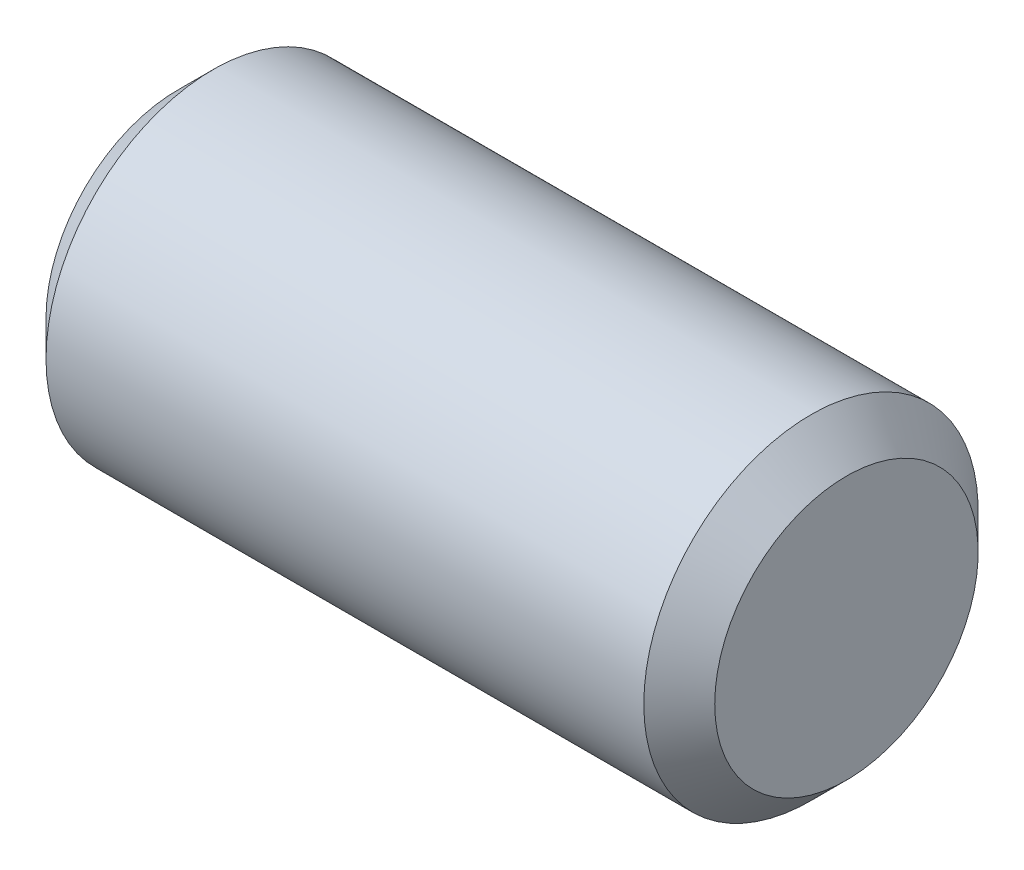
ISO-10303-21;
HEADER;
FILE_DESCRIPTION(('STEP AP214'),'2;1');
FILE_NAME('part.step','',(''),(''),'','','');
FILE_SCHEMA(('AUTOMOTIVE_DESIGN { 1 0 10303 214 1 1 1 1 }'));
ENDSEC;
DATA;
#1=APPLICATION_CONTEXT('core data for automotive mechanical design processes');
#2=APPLICATION_PROTOCOL_DEFINITION('international standard','automotive_design',2000,#1);
#3=PRODUCT_CONTEXT('',#1,'mechanical');
#4=PRODUCT('Part','Part','',(#3));
#5=PRODUCT_RELATED_PRODUCT_CATEGORY('part','',(#4));
#6=PRODUCT_DEFINITION_FORMATION('','',#4);
#7=PRODUCT_DEFINITION_CONTEXT('part definition',#1,'design');
#8=PRODUCT_DEFINITION('design','',#6,#7);
#9=PRODUCT_DEFINITION_SHAPE('','',#8);
#10=(LENGTH_UNIT() NAMED_UNIT(*) SI_UNIT(.MILLI.,.METRE.));
#11=(NAMED_UNIT(*) PLANE_ANGLE_UNIT() SI_UNIT($,.RADIAN.));
#12=(NAMED_UNIT(*) SI_UNIT($,.STERADIAN.) SOLID_ANGLE_UNIT());
#13=UNCERTAINTY_MEASURE_WITH_UNIT(LENGTH_MEASURE(1.E-05),#10,'distance_accuracy_value','');
#14=(GEOMETRIC_REPRESENTATION_CONTEXT(3) GLOBAL_UNCERTAINTY_ASSIGNED_CONTEXT((#13)) GLOBAL_UNIT_ASSIGNED_CONTEXT((#10,
#11,#12)) REPRESENTATION_CONTEXT('',''));
#15=CARTESIAN_POINT('',(0.,0.,0.));
#16=DIRECTION('',(0.,0.,1.));
#17=DIRECTION('',(1.,0.,0.));
#18=AXIS2_PLACEMENT_3D('',#15,#16,#17);
#19=CARTESIAN_POINT('',(-1.80661327730856,0.,0.));
#20=DIRECTION('',(-1.,0.,0.));
#21=DIRECTION('',(0.,0.,1.));
#22=AXIS2_PLACEMENT_3D('',#19,#20,#21);
#23=PLANE('',#22);
#24=CARTESIAN_POINT('',(-1.80661327730856,0.,0.));
#25=DIRECTION('',(-1.,0.,0.));
#26=DIRECTION('',(0.,0.,1.));
#27=AXIS2_PLACEMENT_3D('',#24,#25,#26);
#28=CIRCLE('',#27,0.787867965644037);
#29=CARTESIAN_POINT('',(-1.80661327730856,0.,0.787867965644037));
#30=VERTEX_POINT('',#29);
#31=EDGE_CURVE('E10',#30,#30,#28,.T.);
#32=ORIENTED_EDGE('',*,*,#31,.T.);
#33=EDGE_LOOP('',(#32));
#34=FACE_BOUND('',#33,.T.);
#35=ADVANCED_FACE('F35',(#34),#23,.T.);
#36=CARTESIAN_POINT('',(-1.80661327730856,0.,0.));
#37=DIRECTION('',(1.,0.,0.));
#38=DIRECTION('',(0.,0.,-1.));
#39=AXIS2_PLACEMENT_3D('',#36,#37,#38);
#40=CONICAL_SURFACE('',#39,0.787867965644037,0.785398163397444);
#41=CARTESIAN_POINT('',(-1.5944812429526,0.,0.));
#42=DIRECTION('',(-1.,0.,0.));
#43=DIRECTION('',(0.,0.,1.));
#44=AXIS2_PLACEMENT_3D('',#41,#42,#43);
#45=CIRCLE('',#44,1.);
#46=CARTESIAN_POINT('',(-1.5944812429526,0.,1.));
#47=VERTEX_POINT('',#46);
#48=EDGE_CURVE('E41',#47,#47,#45,.T.);
#49=ORIENTED_EDGE('',*,*,#48,.T.);
#50=EDGE_LOOP('',(#49));
#51=FACE_BOUND('',#50,.T.);
#52=ORIENTED_EDGE('',*,*,#31,.F.);
#53=EDGE_LOOP('',(#52));
#54=FACE_BOUND('',#53,.T.);
#55=ADVANCED_FACE('F67',(#51,#54),#40,.T.);
#56=CARTESIAN_POINT('',(-3.00740740740741,0.,0.));
#57=DIRECTION('',(-1.,0.,0.));
#58=DIRECTION('',(0.,0.,1.));
#59=AXIS2_PLACEMENT_3D('',#56,#57,#58);
#60=CYLINDRICAL_SURFACE('',#59,1.);
#61=CARTESIAN_POINT('',(1.98125468833547,0.,0.));
#62=DIRECTION('',(-1.,0.,0.));
#63=DIRECTION('',(0.,0.,1.));
#64=AXIS2_PLACEMENT_3D('',#61,#62,#63);
#65=CIRCLE('',#64,0.999999999999999);
#66=CARTESIAN_POINT('',(1.98125468833547,0.,0.999999999999999));
#67=VERTEX_POINT('',#66);
#68=EDGE_CURVE('E45',#67,#67,#65,.T.);
#69=ORIENTED_EDGE('',*,*,#68,.T.);
#70=EDGE_LOOP('',(#69));
#71=FACE_BOUND('',#70,.T.);
#72=ORIENTED_EDGE('',*,*,#48,.F.);
#73=EDGE_LOOP('',(#72));
#74=FACE_BOUND('',#73,.T.);
#75=ADVANCED_FACE('F64',(#71,#74),#60,.T.);
#76=CARTESIAN_POINT('',(1.98125468833547,0.,0.));
#77=DIRECTION('',(-1.,0.,0.));
#78=DIRECTION('',(0.,0.,1.));
#79=AXIS2_PLACEMENT_3D('',#76,#77,#78);
#80=CONICAL_SURFACE('',#79,0.999999999999999,0.785398163397437);
#81=CARTESIAN_POINT('',(2.19338672269144,0.,0.));
#82=DIRECTION('',(-1.,0.,0.));
#83=DIRECTION('',(0.,0.,1.));
#84=AXIS2_PLACEMENT_3D('',#81,#82,#83);
#85=CIRCLE('',#84,0.787867965644038);
#86=CARTESIAN_POINT('',(2.19338672269144,0.,0.787867965644038));
#87=VERTEX_POINT('',#86);
#88=EDGE_CURVE('E49',#87,#87,#85,.T.);
#89=ORIENTED_EDGE('',*,*,#88,.T.);
#90=EDGE_LOOP('',(#89));
#91=FACE_BOUND('',#90,.T.);
#92=ORIENTED_EDGE('',*,*,#68,.F.);
#93=EDGE_LOOP('',(#92));
#94=FACE_BOUND('',#93,.T.);
#95=ADVANCED_FACE('F55',(#91,#94),#80,.T.);
#96=CARTESIAN_POINT('',(2.19338672269144,-0.787867965644038,0.));
#97=DIRECTION('',(1.,0.,0.));
#98=DIRECTION('',(0.,0.,-1.));
#99=AXIS2_PLACEMENT_3D('',#96,#97,#98);
#100=PLANE('',#99);
#101=ORIENTED_EDGE('',*,*,#88,.F.);
#102=EDGE_LOOP('',(#101));
#103=FACE_BOUND('',#102,.T.);
#104=ADVANCED_FACE('F58',(#103),#100,.T.);
#105=CLOSED_SHELL('',(#35,#55,#75,#95,#104));
#106=MANIFOLD_SOLID_BREP('B2',#105);
#107=ADVANCED_BREP_SHAPE_REPRESENTATION('',(#18,#106),#14);
#108=SHAPE_DEFINITION_REPRESENTATION(#9,#107);
ENDSEC;
END-ISO-10303-21;
